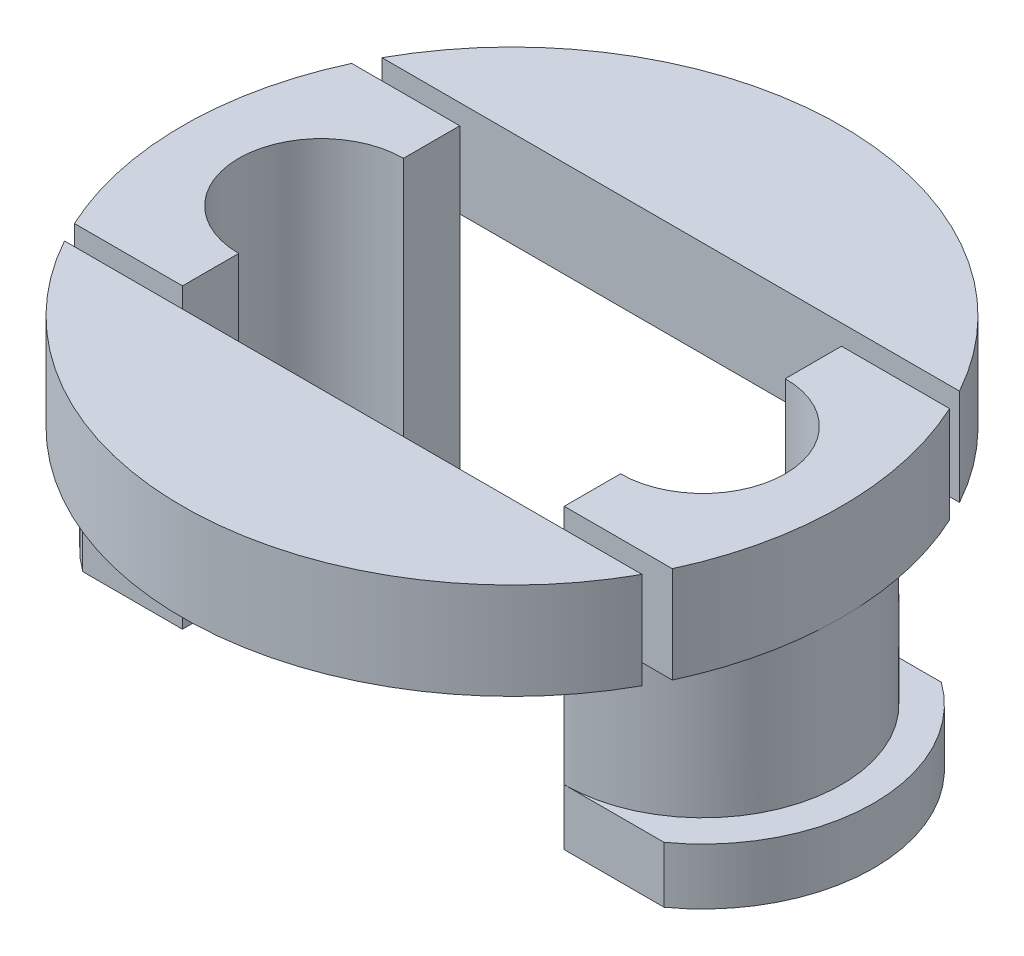
ISO-10303-21;
HEADER;
FILE_DESCRIPTION(('STEP AP214'),'2;1');
FILE_NAME('part.step','',(''),(''),'','','');
FILE_SCHEMA(('AUTOMOTIVE_DESIGN { 1 0 10303 214 1 1 1 1 }'));
ENDSEC;
DATA;
#1=APPLICATION_CONTEXT('core data for automotive mechanical design processes');
#2=APPLICATION_PROTOCOL_DEFINITION('international standard','automotive_design',2000,#1);
#3=PRODUCT_CONTEXT('',#1,'mechanical');
#4=PRODUCT('Part','Part','',(#3));
#5=PRODUCT_RELATED_PRODUCT_CATEGORY('part','',(#4));
#6=PRODUCT_DEFINITION_FORMATION('','',#4);
#7=PRODUCT_DEFINITION_CONTEXT('part definition',#1,'design');
#8=PRODUCT_DEFINITION('design','',#6,#7);
#9=PRODUCT_DEFINITION_SHAPE('','',#8);
#10=(LENGTH_UNIT() NAMED_UNIT(*) SI_UNIT(.MILLI.,.METRE.));
#11=(NAMED_UNIT(*) PLANE_ANGLE_UNIT() SI_UNIT($,.RADIAN.));
#12=(NAMED_UNIT(*) SI_UNIT($,.STERADIAN.) SOLID_ANGLE_UNIT());
#13=UNCERTAINTY_MEASURE_WITH_UNIT(LENGTH_MEASURE(1.E-05),#10,'distance_accuracy_value','');
#14=(GEOMETRIC_REPRESENTATION_CONTEXT(3) GLOBAL_UNCERTAINTY_ASSIGNED_CONTEXT((#13)) GLOBAL_UNIT_ASSIGNED_CONTEXT((#10,
#11,#12)) REPRESENTATION_CONTEXT('',''));
#15=CARTESIAN_POINT('',(0.,0.,0.));
#16=DIRECTION('',(0.,0.,1.));
#17=DIRECTION('',(1.,0.,0.));
#18=AXIS2_PLACEMENT_3D('',#15,#16,#17);
#19=CARTESIAN_POINT('',(-5.6,4.,3.45));
#20=DIRECTION('',(0.,0.,-1.));
#21=DIRECTION('',(-1.,0.,0.));
#22=AXIS2_PLACEMENT_3D('',#19,#20,#21);
#23=PLANE('',#22);
#24=DIRECTION('',(-1.,0.,0.));
#25=VECTOR('',#24,1.);
#26=CARTESIAN_POINT('',(3.9,0.4,3.45));
#27=LINE('',#26,#25);
#28=CARTESIAN_POINT('',(6.38193472919817,0.4,3.45));
#29=VERTEX_POINT('',#28);
#30=CARTESIAN_POINT('',(3.9,0.400000000000001,3.45));
#31=VERTEX_POINT('',#30);
#32=EDGE_CURVE('E221',#29,#31,#27,.T.);
#33=ORIENTED_EDGE('',*,*,#32,.T.);
#34=DIRECTION('',(0.,-1.,0.));
#35=VECTOR('',#34,1.);
#36=CARTESIAN_POINT('',(3.9,18.6476202422854,3.45));
#37=LINE('',#36,#35);
#38=CARTESIAN_POINT('',(3.9,-1.,3.45));
#39=VERTEX_POINT('',#38);
#40=EDGE_CURVE('E163',#31,#39,#37,.T.);
#41=ORIENTED_EDGE('',*,*,#40,.T.);
#42=DIRECTION('',(-1.,0.,0.));
#43=VECTOR('',#42,1.);
#44=CARTESIAN_POINT('',(3.9,-1.,3.45));
#45=LINE('',#44,#43);
#46=CARTESIAN_POINT('',(6.38193472919817,-1.,3.45));
#47=VERTEX_POINT('',#46);
#48=EDGE_CURVE('E176',#47,#39,#45,.T.);
#49=ORIENTED_EDGE('',*,*,#48,.F.);
#50=DIRECTION('',(0.,-1.,0.));
#51=VECTOR('',#50,1.);
#52=CARTESIAN_POINT('',(6.38193472919817,0.4,3.45));
#53=LINE('',#52,#51);
#54=EDGE_CURVE('E162',#29,#47,#53,.T.);
#55=ORIENTED_EDGE('',*,*,#54,.F.);
#56=EDGE_LOOP('',(#33,#41,#49,#55));
#57=FACE_BOUND('',#56,.T.);
#58=ADVANCED_FACE('F43',(#57),#23,.F.);
#59=CARTESIAN_POINT('',(-5.6,4.,-3.45));
#60=DIRECTION('',(0.,0.,1.));
#61=DIRECTION('',(1.,0.,0.));
#62=AXIS2_PLACEMENT_3D('',#59,#60,#61);
#63=PLANE('',#62);
#64=DIRECTION('',(1.,0.,0.));
#65=VECTOR('',#64,1.);
#66=CARTESIAN_POINT('',(-5.6,-1.,-3.45));
#67=LINE('',#66,#65);
#68=CARTESIAN_POINT('',(3.9,-1.,-3.44999999999999));
#69=VERTEX_POINT('',#68);
#70=CARTESIAN_POINT('',(6.38193472919817,-1.,-3.45));
#71=VERTEX_POINT('',#70);
#72=EDGE_CURVE('E172',#69,#71,#67,.T.);
#73=ORIENTED_EDGE('',*,*,#72,.F.);
#74=DIRECTION('',(0.,-1.,0.));
#75=VECTOR('',#74,1.);
#76=CARTESIAN_POINT('',(3.9,18.6476202422854,-3.44999999999999));
#77=LINE('',#76,#75);
#78=CARTESIAN_POINT('',(3.9,0.400000000000001,-3.44999999999999));
#79=VERTEX_POINT('',#78);
#80=EDGE_CURVE('E52',#79,#69,#77,.T.);
#81=ORIENTED_EDGE('',*,*,#80,.F.);
#82=DIRECTION('',(1.,0.,0.));
#83=VECTOR('',#82,1.);
#84=CARTESIAN_POINT('',(3.9,0.4,-3.45));
#85=LINE('',#84,#83);
#86=CARTESIAN_POINT('',(6.38193472919817,0.4,-3.45));
#87=VERTEX_POINT('',#86);
#88=EDGE_CURVE('E186',#79,#87,#85,.T.);
#89=ORIENTED_EDGE('',*,*,#88,.T.);
#90=DIRECTION('',(0.,-1.,0.));
#91=VECTOR('',#90,1.);
#92=CARTESIAN_POINT('',(6.38193472919817,0.4,-3.45));
#93=LINE('',#92,#91);
#94=EDGE_CURVE('E166',#87,#71,#93,.T.);
#95=ORIENTED_EDGE('',*,*,#94,.T.);
#96=EDGE_LOOP('',(#73,#81,#89,#95));
#97=FACE_BOUND('',#96,.T.);
#98=ADVANCED_FACE('F212',(#97),#63,.F.);
#99=CARTESIAN_POINT('',(-0.849999999999999,6.4,0.));
#100=DIRECTION('',(0.,1.,0.));
#101=DIRECTION('',(0.,0.,1.));
#102=AXIS2_PLACEMENT_3D('',#99,#100,#101);
#103=PLANE('',#102);
#104=DIRECTION('',(-1.,0.,0.));
#105=VECTOR('',#104,1.);
#106=CARTESIAN_POINT('',(3.9,6.4,-3.44999999999999));
#107=LINE('',#106,#105);
#108=CARTESIAN_POINT('',(6.58891793206512,6.4,-3.45));
#109=VERTEX_POINT('',#108);
#110=CARTESIAN_POINT('',(3.9,6.4,-3.44999999999999));
#111=VERTEX_POINT('',#110);
#112=EDGE_CURVE('E132',#109,#111,#107,.T.);
#113=ORIENTED_EDGE('',*,*,#112,.T.);
#114=DIRECTION('',(0.,0.,1.));
#115=VECTOR('',#114,1.);
#116=CARTESIAN_POINT('',(3.9,6.4,3.45));
#117=LINE('',#116,#115);
#118=CARTESIAN_POINT('',(3.9,6.4,-2.05));
#119=VERTEX_POINT('',#118);
#120=EDGE_CURVE('E165',#111,#119,#117,.T.);
#121=ORIENTED_EDGE('',*,*,#120,.T.);
#122=CARTESIAN_POINT('',(3.9,6.4,0.));
#123=DIRECTION('',(0.,1.,0.));
#124=DIRECTION('',(0.,0.,1.));
#125=AXIS2_PLACEMENT_3D('',#122,#123,#124);
#126=CIRCLE('',#125,2.05);
#127=CARTESIAN_POINT('',(3.9,6.4,2.05));
#128=VERTEX_POINT('',#127);
#129=EDGE_CURVE('E196',#128,#119,#126,.T.);
#130=ORIENTED_EDGE('',*,*,#129,.F.);
#131=CARTESIAN_POINT('',(3.9,6.4,3.45));
#132=VERTEX_POINT('',#131);
#133=EDGE_CURVE('E169',#128,#132,#117,.T.);
#134=ORIENTED_EDGE('',*,*,#133,.T.);
#135=DIRECTION('',(1.,0.,0.));
#136=VECTOR('',#135,1.);
#137=CARTESIAN_POINT('',(3.9,6.4,3.45));
#138=LINE('',#137,#136);
#139=CARTESIAN_POINT('',(6.58891793206512,6.4,3.45));
#140=VERTEX_POINT('',#139);
#141=EDGE_CURVE('E98',#132,#140,#138,.T.);
#142=ORIENTED_EDGE('',*,*,#141,.T.);
#143=CARTESIAN_POINT('',(-0.849999999999999,6.4,0.));
#144=DIRECTION('',(0.,1.,0.));
#145=DIRECTION('',(0.,0.,1.));
#146=AXIS2_PLACEMENT_3D('',#143,#144,#145);
#147=CIRCLE('',#146,8.2);
#148=EDGE_CURVE('E170',#140,#109,#147,.T.);
#149=ORIENTED_EDGE('',*,*,#148,.T.);
#150=EDGE_LOOP('',(#113,#121,#130,#134,#142,#149));
#151=FACE_BOUND('',#150,.T.);
#152=ADVANCED_FACE('F239',(#151),#103,.T.);
#153=CARTESIAN_POINT('',(-0.849999999999999,4.,0.));
#154=DIRECTION('',(0.,1.,0.));
#155=DIRECTION('',(0.,0.,1.));
#156=AXIS2_PLACEMENT_3D('',#153,#154,#155);
#157=PLANE('',#156);
#158=CARTESIAN_POINT('',(-0.849999999999999,4.,0.));
#159=DIRECTION('',(0.,1.,0.));
#160=DIRECTION('',(0.,0.,1.));
#161=AXIS2_PLACEMENT_3D('',#158,#159,#160);
#162=CIRCLE('',#161,8.2);
#163=CARTESIAN_POINT('',(6.58891793206512,4.,3.45));
#164=VERTEX_POINT('',#163);
#165=CARTESIAN_POINT('',(7.35,4.,0.));
#166=VERTEX_POINT('',#165);
#167=EDGE_CURVE('E148',#164,#166,#162,.T.);
#168=ORIENTED_EDGE('',*,*,#167,.F.);
#169=DIRECTION('',(-1.,0.,0.));
#170=VECTOR('',#169,1.);
#171=CARTESIAN_POINT('',(-0.849999999999999,4.,3.45));
#172=LINE('',#171,#170);
#173=CARTESIAN_POINT('',(3.9,4.,3.45));
#174=VERTEX_POINT('',#173);
#175=EDGE_CURVE('E103',#164,#174,#172,.T.);
#176=ORIENTED_EDGE('',*,*,#175,.T.);
#177=CARTESIAN_POINT('',(3.9,4.,0.));
#178=DIRECTION('',(0.,1.,0.));
#179=DIRECTION('',(0.,0.,1.));
#180=AXIS2_PLACEMENT_3D('',#177,#178,#179);
#181=CIRCLE('',#180,3.45);
#182=EDGE_CURVE('E175',#174,#166,#181,.T.);
#183=ORIENTED_EDGE('',*,*,#182,.T.);
#184=EDGE_LOOP('',(#168,#176,#183));
#185=FACE_BOUND('',#184,.T.);
#186=ADVANCED_FACE('F237',(#185),#157,.F.);
#187=CARTESIAN_POINT('',(-5.6,-1.,0.));
#188=DIRECTION('',(0.,-1.,0.));
#189=DIRECTION('',(0.,0.,-1.));
#190=AXIS2_PLACEMENT_3D('',#187,#188,#189);
#191=PLANE('',#190);
#192=DIRECTION('',(0.,0.,1.));
#193=VECTOR('',#192,1.);
#194=CARTESIAN_POINT('',(3.9,-1.,3.45));
#195=LINE('',#194,#193);
#196=CARTESIAN_POINT('',(3.9,-1.,-2.05));
#197=VERTEX_POINT('',#196);
#198=EDGE_CURVE('E12',#69,#197,#195,.T.);
#199=ORIENTED_EDGE('',*,*,#198,.F.);
#200=ORIENTED_EDGE('',*,*,#72,.T.);
#201=CARTESIAN_POINT('',(3.9,-1.,0.));
#202=DIRECTION('',(0.,-1.,0.));
#203=DIRECTION('',(0.,0.,1.));
#204=AXIS2_PLACEMENT_3D('',#201,#202,#203);
#205=CIRCLE('',#204,4.25);
#206=EDGE_CURVE('E174',#71,#47,#205,.T.);
#207=ORIENTED_EDGE('',*,*,#206,.T.);
#208=ORIENTED_EDGE('',*,*,#48,.T.);
#209=CARTESIAN_POINT('',(3.9,-1.,2.05));
#210=VERTEX_POINT('',#209);
#211=EDGE_CURVE('E54',#210,#39,#195,.T.);
#212=ORIENTED_EDGE('',*,*,#211,.F.);
#213=CARTESIAN_POINT('',(3.9,-1.,0.));
#214=DIRECTION('',(0.,-1.,0.));
#215=DIRECTION('',(0.,0.,-1.));
#216=AXIS2_PLACEMENT_3D('',#213,#214,#215);
#217=CIRCLE('',#216,2.05);
#218=EDGE_CURVE('E193',#197,#210,#217,.T.);
#219=ORIENTED_EDGE('',*,*,#218,.F.);
#220=EDGE_LOOP('',(#199,#200,#207,#208,#212,#219));
#221=FACE_BOUND('',#220,.T.);
#222=ADVANCED_FACE('F211',(#221),#191,.T.);
#223=CARTESIAN_POINT('',(3.9,4.,-3.44999999999999));
#224=VERTEX_POINT('',#223);
#225=EDGE_CURVE('E144',#166,#224,#181,.T.);
#226=ORIENTED_EDGE('',*,*,#225,.T.);
#227=DIRECTION('',(1.,0.,0.));
#228=VECTOR('',#227,1.);
#229=CARTESIAN_POINT('',(-0.85,4.,-3.44999999999999));
#230=LINE('',#229,#228);
#231=CARTESIAN_POINT('',(6.58891793206512,4.,-3.45));
#232=VERTEX_POINT('',#231);
#233=EDGE_CURVE('E129',#224,#232,#230,.T.);
#234=ORIENTED_EDGE('',*,*,#233,.T.);
#235=EDGE_CURVE('E46',#166,#232,#162,.T.);
#236=ORIENTED_EDGE('',*,*,#235,.F.);
#237=EDGE_LOOP('',(#226,#234,#236));
#238=FACE_BOUND('',#237,.T.);
#239=ADVANCED_FACE('F142',(#238),#157,.F.);
#240=CARTESIAN_POINT('',(-0.849999999999999,6.4,0.));
#241=DIRECTION('',(0.,-1.,0.));
#242=DIRECTION('',(0.,0.,-1.));
#243=AXIS2_PLACEMENT_3D('',#240,#241,#242);
#244=CYLINDRICAL_SURFACE('',#243,8.2);
#245=ORIENTED_EDGE('',*,*,#235,.T.);
#246=DIRECTION('',(0.,-1.,0.));
#247=VECTOR('',#246,1.);
#248=CARTESIAN_POINT('',(6.58891793206512,6.4,-3.45));
#249=LINE('',#248,#247);
#250=EDGE_CURVE('E125',#232,#109,#249,.F.);
#251=ORIENTED_EDGE('',*,*,#250,.T.);
#252=ORIENTED_EDGE('',*,*,#148,.F.);
#253=DIRECTION('',(0.,-1.,0.));
#254=VECTOR('',#253,1.);
#255=CARTESIAN_POINT('',(6.58891793206512,6.4,3.45));
#256=LINE('',#255,#254);
#257=EDGE_CURVE('E137',#140,#164,#256,.T.);
#258=ORIENTED_EDGE('',*,*,#257,.T.);
#259=ORIENTED_EDGE('',*,*,#167,.T.);
#260=EDGE_LOOP('',(#245,#251,#252,#258,#259));
#261=FACE_BOUND('',#260,.T.);
#262=ADVANCED_FACE('F146',(#261),#244,.T.);
#263=CARTESIAN_POINT('',(3.9,4.,0.));
#264=DIRECTION('',(0.,-1.,0.));
#265=DIRECTION('',(0.,0.,-1.));
#266=AXIS2_PLACEMENT_3D('',#263,#264,#265);
#267=CYLINDRICAL_SURFACE('',#266,3.45);
#268=DIRECTION('',(0.,-1.,0.));
#269=VECTOR('',#268,1.);
#270=CARTESIAN_POINT('',(3.9,4.,3.45));
#271=LINE('',#270,#269);
#272=EDGE_CURVE('E149',#174,#31,#271,.T.);
#273=ORIENTED_EDGE('',*,*,#272,.T.);
#274=CARTESIAN_POINT('',(3.9,0.4,0.));
#275=DIRECTION('',(0.,1.,0.));
#276=DIRECTION('',(0.,0.,1.));
#277=AXIS2_PLACEMENT_3D('',#274,#275,#276);
#278=CIRCLE('',#277,3.45);
#279=EDGE_CURVE('E151',#31,#79,#278,.T.);
#280=ORIENTED_EDGE('',*,*,#279,.T.);
#281=DIRECTION('',(0.,-1.,0.));
#282=VECTOR('',#281,1.);
#283=CARTESIAN_POINT('',(3.9,4.,-3.45));
#284=LINE('',#283,#282);
#285=EDGE_CURVE('E158',#224,#79,#284,.T.);
#286=ORIENTED_EDGE('',*,*,#285,.F.);
#287=ORIENTED_EDGE('',*,*,#225,.F.);
#288=ORIENTED_EDGE('',*,*,#182,.F.);
#289=EDGE_LOOP('',(#273,#280,#286,#287,#288));
#290=FACE_BOUND('',#289,.T.);
#291=ADVANCED_FACE('F229',(#290),#267,.T.);
#292=CARTESIAN_POINT('',(3.9,4.,0.));
#293=DIRECTION('',(0.,-1.,0.));
#294=DIRECTION('',(0.,0.,-1.));
#295=AXIS2_PLACEMENT_3D('',#292,#293,#294);
#296=CYLINDRICAL_SURFACE('',#295,2.05);
#297=DIRECTION('',(0.,-1.,0.));
#298=VECTOR('',#297,1.);
#299=CARTESIAN_POINT('',(3.9,4.,-2.05));
#300=LINE('',#299,#298);
#301=EDGE_CURVE('E197',#119,#197,#300,.T.);
#302=ORIENTED_EDGE('',*,*,#301,.T.);
#303=ORIENTED_EDGE('',*,*,#218,.T.);
#304=DIRECTION('',(0.,-1.,0.));
#305=VECTOR('',#304,1.);
#306=CARTESIAN_POINT('',(3.9,4.,2.05));
#307=LINE('',#306,#305);
#308=EDGE_CURVE('E161',#128,#210,#307,.T.);
#309=ORIENTED_EDGE('',*,*,#308,.F.);
#310=ORIENTED_EDGE('',*,*,#129,.T.);
#311=EDGE_LOOP('',(#302,#303,#309,#310));
#312=FACE_BOUND('',#311,.T.);
#313=ADVANCED_FACE('F262',(#312),#296,.F.);
#314=CARTESIAN_POINT('',(3.9,0.4,0.));
#315=DIRECTION('',(0.,-1.,0.));
#316=DIRECTION('',(0.,0.,-1.));
#317=AXIS2_PLACEMENT_3D('',#314,#315,#316);
#318=CYLINDRICAL_SURFACE('',#317,4.25);
#319=ORIENTED_EDGE('',*,*,#206,.F.);
#320=ORIENTED_EDGE('',*,*,#94,.F.);
#321=CARTESIAN_POINT('',(3.9,0.4,0.));
#322=DIRECTION('',(0.,-1.,0.));
#323=DIRECTION('',(0.,0.,1.));
#324=AXIS2_PLACEMENT_3D('',#321,#322,#323);
#325=CIRCLE('',#324,4.25);
#326=EDGE_CURVE('E192',#87,#29,#325,.T.);
#327=ORIENTED_EDGE('',*,*,#326,.T.);
#328=ORIENTED_EDGE('',*,*,#54,.T.);
#329=EDGE_LOOP('',(#319,#320,#327,#328));
#330=FACE_BOUND('',#329,.T.);
#331=ADVANCED_FACE('F216',(#330),#318,.T.);
#332=CARTESIAN_POINT('',(3.9,0.4,0.));
#333=DIRECTION('',(0.,1.,0.));
#334=DIRECTION('',(0.,0.,1.));
#335=AXIS2_PLACEMENT_3D('',#332,#333,#334);
#336=PLANE('',#335);
#337=ORIENTED_EDGE('',*,*,#326,.F.);
#338=ORIENTED_EDGE('',*,*,#88,.F.);
#339=ORIENTED_EDGE('',*,*,#279,.F.);
#340=ORIENTED_EDGE('',*,*,#32,.F.);
#341=EDGE_LOOP('',(#337,#338,#339,#340));
#342=FACE_BOUND('',#341,.T.);
#343=ADVANCED_FACE('F224',(#342),#336,.T.);
#344=CARTESIAN_POINT('',(3.9,18.6476202422854,3.45));
#345=DIRECTION('',(0.,0.,-1.));
#346=DIRECTION('',(-1.,0.,0.));
#347=AXIS2_PLACEMENT_3D('',#344,#345,#346);
#348=PLANE('',#347);
#349=ORIENTED_EDGE('',*,*,#257,.F.);
#350=ORIENTED_EDGE('',*,*,#141,.F.);
#351=EDGE_CURVE('E159',#132,#174,#37,.T.);
#352=ORIENTED_EDGE('',*,*,#351,.T.);
#353=ORIENTED_EDGE('',*,*,#175,.F.);
#354=EDGE_LOOP('',(#349,#350,#352,#353));
#355=FACE_BOUND('',#354,.T.);
#356=ADVANCED_FACE('F235',(#355),#348,.F.);
#357=CARTESIAN_POINT('',(3.9,18.6476202422854,3.45));
#358=DIRECTION('',(1.,0.,0.));
#359=DIRECTION('',(0.,0.,-1.));
#360=AXIS2_PLACEMENT_3D('',#357,#358,#359);
#361=PLANE('',#360);
#362=ORIENTED_EDGE('',*,*,#308,.T.);
#363=ORIENTED_EDGE('',*,*,#211,.T.);
#364=ORIENTED_EDGE('',*,*,#40,.F.);
#365=ORIENTED_EDGE('',*,*,#272,.F.);
#366=ORIENTED_EDGE('',*,*,#351,.F.);
#367=ORIENTED_EDGE('',*,*,#133,.F.);
#368=EDGE_LOOP('',(#362,#363,#364,#365,#366,#367));
#369=FACE_BOUND('',#368,.T.);
#370=ADVANCED_FACE('F232',(#369),#361,.F.);
#371=CARTESIAN_POINT('',(3.9,18.6476202422854,-3.44999999999999));
#372=DIRECTION('',(0.,0.,1.));
#373=DIRECTION('',(1.,0.,0.));
#374=AXIS2_PLACEMENT_3D('',#371,#372,#373);
#375=PLANE('',#374);
#376=EDGE_CURVE('E156',#111,#224,#77,.T.);
#377=ORIENTED_EDGE('',*,*,#376,.F.);
#378=ORIENTED_EDGE('',*,*,#112,.F.);
#379=ORIENTED_EDGE('',*,*,#250,.F.);
#380=ORIENTED_EDGE('',*,*,#233,.F.);
#381=EDGE_LOOP('',(#377,#378,#379,#380));
#382=FACE_BOUND('',#381,.T.);
#383=ADVANCED_FACE('F128',(#382),#375,.F.);
#384=ORIENTED_EDGE('',*,*,#301,.F.);
#385=ORIENTED_EDGE('',*,*,#120,.F.);
#386=ORIENTED_EDGE('',*,*,#376,.T.);
#387=ORIENTED_EDGE('',*,*,#285,.T.);
#388=ORIENTED_EDGE('',*,*,#80,.T.);
#389=ORIENTED_EDGE('',*,*,#198,.T.);
#390=EDGE_LOOP('',(#384,#385,#386,#387,#388,#389));
#391=FACE_BOUND('',#390,.T.);
#392=ADVANCED_FACE('F205',(#391),#361,.F.);
#393=CLOSED_SHELL('',(#58,#98,#152,#186,#222,#239,#262,#291,#313,#331,#343,#356,#370,#383,#392));
#394=MANIFOLD_SOLID_BREP('B2',#393);
#395=CARTESIAN_POINT('',(-5.1,18.6476202422854,3.95));
#396=DIRECTION('',(0.,0.,1.));
#397=DIRECTION('',(1.,0.,0.));
#398=AXIS2_PLACEMENT_3D('',#395,#396,#397);
#399=PLANE('',#398);
#400=DIRECTION('',(0.,-1.,0.));
#401=VECTOR('',#400,1.);
#402=CARTESIAN_POINT('',(-8.03592374020209,6.4,3.95));
#403=LINE('',#402,#401);
#404=CARTESIAN_POINT('',(-8.03592374020209,6.4,3.95));
#405=VERTEX_POINT('',#404);
#406=CARTESIAN_POINT('',(-8.03592374020209,4.,3.95));
#407=VERTEX_POINT('',#406);
#408=EDGE_CURVE('E435',#405,#407,#403,.T.);
#409=ORIENTED_EDGE('',*,*,#408,.F.);
#410=DIRECTION('',(-1.,0.,0.));
#411=VECTOR('',#410,1.);
#412=CARTESIAN_POINT('',(3.4,6.4,3.95));
#413=LINE('',#412,#411);
#414=CARTESIAN_POINT('',(6.33592374020209,6.4,3.95));
#415=VERTEX_POINT('',#414);
#416=EDGE_CURVE('E415',#415,#405,#413,.T.);
#417=ORIENTED_EDGE('',*,*,#416,.F.);
#418=DIRECTION('',(0.,-1.,0.));
#419=VECTOR('',#418,1.);
#420=CARTESIAN_POINT('',(6.33592374020209,6.4,3.95));
#421=LINE('',#420,#419);
#422=CARTESIAN_POINT('',(6.33592374020209,4.,3.95));
#423=VERTEX_POINT('',#422);
#424=EDGE_CURVE('E422',#423,#415,#421,.F.);
#425=ORIENTED_EDGE('',*,*,#424,.F.);
#426=DIRECTION('',(1.,0.,0.));
#427=VECTOR('',#426,1.);
#428=CARTESIAN_POINT('',(-0.85,4.,3.95));
#429=LINE('',#428,#427);
#430=EDGE_CURVE('E432',#407,#423,#429,.T.);
#431=ORIENTED_EDGE('',*,*,#430,.F.);
#432=EDGE_LOOP('',(#409,#417,#425,#431));
#433=FACE_BOUND('',#432,.T.);
#434=ADVANCED_FACE('F406',(#433),#399,.F.);
#435=CARTESIAN_POINT('',(-0.849999999999999,6.4,0.));
#436=DIRECTION('',(0.,-1.,0.));
#437=DIRECTION('',(0.,0.,-1.));
#438=AXIS2_PLACEMENT_3D('',#435,#436,#437);
#439=CYLINDRICAL_SURFACE('',#438,8.2);
#440=CARTESIAN_POINT('',(-0.849999999999999,4.,0.));
#441=DIRECTION('',(0.,1.,0.));
#442=DIRECTION('',(0.,0.,1.));
#443=AXIS2_PLACEMENT_3D('',#440,#441,#442);
#444=CIRCLE('',#443,8.2);
#445=EDGE_CURVE('E410',#407,#423,#444,.T.);
#446=ORIENTED_EDGE('',*,*,#445,.T.);
#447=ORIENTED_EDGE('',*,*,#424,.T.);
#448=CARTESIAN_POINT('',(-0.849999999999999,6.4,0.));
#449=DIRECTION('',(0.,1.,0.));
#450=DIRECTION('',(0.,0.,1.));
#451=AXIS2_PLACEMENT_3D('',#448,#449,#450);
#452=CIRCLE('',#451,8.2);
#453=EDGE_CURVE('E41',#405,#415,#452,.T.);
#454=ORIENTED_EDGE('',*,*,#453,.F.);
#455=ORIENTED_EDGE('',*,*,#408,.T.);
#456=EDGE_LOOP('',(#446,#447,#454,#455));
#457=FACE_BOUND('',#456,.T.);
#458=ADVANCED_FACE('F440',(#457),#439,.T.);
#459=CARTESIAN_POINT('',(-0.849999999999999,4.,0.));
#460=DIRECTION('',(0.,1.,0.));
#461=DIRECTION('',(0.,0.,1.));
#462=AXIS2_PLACEMENT_3D('',#459,#460,#461);
#463=PLANE('',#462);
#464=ORIENTED_EDGE('',*,*,#445,.F.);
#465=ORIENTED_EDGE('',*,*,#430,.T.);
#466=EDGE_LOOP('',(#464,#465));
#467=FACE_BOUND('',#466,.T.);
#468=ADVANCED_FACE('F444',(#467),#463,.F.);
#469=CARTESIAN_POINT('',(-0.849999999999999,6.4,0.));
#470=DIRECTION('',(0.,1.,0.));
#471=DIRECTION('',(0.,0.,1.));
#472=AXIS2_PLACEMENT_3D('',#469,#470,#471);
#473=PLANE('',#472);
#474=ORIENTED_EDGE('',*,*,#416,.T.);
#475=ORIENTED_EDGE('',*,*,#453,.T.);
#476=EDGE_LOOP('',(#474,#475));
#477=FACE_BOUND('',#476,.T.);
#478=ADVANCED_FACE('F408',(#477),#473,.T.);
#479=CLOSED_SHELL('',(#434,#458,#468,#478));
#480=MANIFOLD_SOLID_BREP('B6',#479);
#481=CARTESIAN_POINT('',(-5.1,18.6476202422854,-3.95));
#482=DIRECTION('',(0.,0.,-1.));
#483=DIRECTION('',(-1.,0.,0.));
#484=AXIS2_PLACEMENT_3D('',#481,#482,#483);
#485=PLANE('',#484);
#486=DIRECTION('',(-1.,0.,0.));
#487=VECTOR('',#486,1.);
#488=CARTESIAN_POINT('',(-0.849999999999999,4.,-3.95));
#489=LINE('',#488,#487);
#490=CARTESIAN_POINT('',(6.33592374020209,4.,-3.94999999999999));
#491=VERTEX_POINT('',#490);
#492=CARTESIAN_POINT('',(-8.03592374020209,4.,-3.95));
#493=VERTEX_POINT('',#492);
#494=EDGE_CURVE('E508',#491,#493,#489,.T.);
#495=ORIENTED_EDGE('',*,*,#494,.F.);
#496=DIRECTION('',(0.,-1.,0.));
#497=VECTOR('',#496,1.);
#498=CARTESIAN_POINT('',(6.33592374020209,6.4,-3.94999999999999));
#499=LINE('',#498,#497);
#500=CARTESIAN_POINT('',(6.33592374020209,6.4,-3.94999999999999));
#501=VERTEX_POINT('',#500);
#502=EDGE_CURVE('E404',#501,#491,#499,.T.);
#503=ORIENTED_EDGE('',*,*,#502,.F.);
#504=DIRECTION('',(1.,0.,0.));
#505=VECTOR('',#504,1.);
#506=CARTESIAN_POINT('',(-5.1,6.4,-3.95));
#507=LINE('',#506,#505);
#508=CARTESIAN_POINT('',(-8.03592374020209,6.4,-3.95));
#509=VERTEX_POINT('',#508);
#510=EDGE_CURVE('E522',#509,#501,#507,.T.);
#511=ORIENTED_EDGE('',*,*,#510,.F.);
#512=DIRECTION('',(0.,-1.,0.));
#513=VECTOR('',#512,1.);
#514=CARTESIAN_POINT('',(-8.03592374020209,6.4,-3.95));
#515=LINE('',#514,#513);
#516=EDGE_CURVE('E501',#493,#509,#515,.F.);
#517=ORIENTED_EDGE('',*,*,#516,.F.);
#518=EDGE_LOOP('',(#495,#503,#511,#517));
#519=FACE_BOUND('',#518,.T.);
#520=ADVANCED_FACE('F493',(#519),#485,.F.);
#521=CARTESIAN_POINT('',(-0.849999999999999,6.4,0.));
#522=DIRECTION('',(0.,-1.,0.));
#523=DIRECTION('',(0.,0.,-1.));
#524=AXIS2_PLACEMENT_3D('',#521,#522,#523);
#525=CYLINDRICAL_SURFACE('',#524,8.2);
#526=CARTESIAN_POINT('',(-0.849999999999999,6.4,0.));
#527=DIRECTION('',(0.,1.,0.));
#528=DIRECTION('',(0.,0.,1.));
#529=AXIS2_PLACEMENT_3D('',#526,#527,#528);
#530=CIRCLE('',#529,8.2);
#531=EDGE_CURVE('E524',#501,#509,#530,.T.);
#532=ORIENTED_EDGE('',*,*,#531,.F.);
#533=ORIENTED_EDGE('',*,*,#502,.T.);
#534=CARTESIAN_POINT('',(-0.849999999999999,4.,0.));
#535=DIRECTION('',(0.,1.,0.));
#536=DIRECTION('',(0.,0.,1.));
#537=AXIS2_PLACEMENT_3D('',#534,#535,#536);
#538=CIRCLE('',#537,8.2);
#539=EDGE_CURVE('E515',#491,#493,#538,.T.);
#540=ORIENTED_EDGE('',*,*,#539,.T.);
#541=ORIENTED_EDGE('',*,*,#516,.T.);
#542=EDGE_LOOP('',(#532,#533,#540,#541));
#543=FACE_BOUND('',#542,.T.);
#544=ADVANCED_FACE('F526',(#543),#525,.T.);
#545=CARTESIAN_POINT('',(-0.849999999999999,4.,0.));
#546=DIRECTION('',(0.,1.,0.));
#547=DIRECTION('',(0.,0.,1.));
#548=AXIS2_PLACEMENT_3D('',#545,#546,#547);
#549=PLANE('',#548);
#550=ORIENTED_EDGE('',*,*,#539,.F.);
#551=ORIENTED_EDGE('',*,*,#494,.T.);
#552=EDGE_LOOP('',(#550,#551));
#553=FACE_BOUND('',#552,.T.);
#554=ADVANCED_FACE('F531',(#553),#549,.F.);
#555=CARTESIAN_POINT('',(-0.849999999999999,6.4,0.));
#556=DIRECTION('',(0.,1.,0.));
#557=DIRECTION('',(0.,0.,1.));
#558=AXIS2_PLACEMENT_3D('',#555,#556,#557);
#559=PLANE('',#558);
#560=ORIENTED_EDGE('',*,*,#510,.T.);
#561=ORIENTED_EDGE('',*,*,#531,.T.);
#562=EDGE_LOOP('',(#560,#561));
#563=FACE_BOUND('',#562,.T.);
#564=ADVANCED_FACE('F495',(#563),#559,.T.);
#565=CLOSED_SHELL('',(#520,#544,#554,#564));
#566=MANIFOLD_SOLID_BREP('B35',#565);
#567=CARTESIAN_POINT('',(-5.6,0.4,0.));
#568=DIRECTION('',(0.,-1.,0.));
#569=DIRECTION('',(0.,0.,-1.));
#570=AXIS2_PLACEMENT_3D('',#567,#568,#569);
#571=PLANE('',#570);
#572=CARTESIAN_POINT('',(-5.6,0.4,0.));
#573=DIRECTION('',(0.,1.,0.));
#574=DIRECTION('',(0.,0.,-1.));
#575=AXIS2_PLACEMENT_3D('',#572,#573,#574);
#576=CIRCLE('',#575,3.45);
#577=CARTESIAN_POINT('',(-5.6,0.400000000000001,-3.45));
#578=VERTEX_POINT('',#577);
#579=CARTESIAN_POINT('',(-5.6,0.400000000000001,3.45));
#580=VERTEX_POINT('',#579);
#581=EDGE_CURVE('E705',#578,#580,#576,.T.);
#582=ORIENTED_EDGE('',*,*,#581,.F.);
#583=DIRECTION('',(1.,0.,0.));
#584=VECTOR('',#583,1.);
#585=CARTESIAN_POINT('',(-5.6,0.4,-3.45));
#586=LINE('',#585,#584);
#587=CARTESIAN_POINT('',(-8.08193472919817,0.4,-3.45));
#588=VERTEX_POINT('',#587);
#589=EDGE_CURVE('E669',#588,#578,#586,.T.);
#590=ORIENTED_EDGE('',*,*,#589,.F.);
#591=CARTESIAN_POINT('',(-5.6,0.4,0.));
#592=DIRECTION('',(0.,-1.,0.));
#593=DIRECTION('',(0.,0.,-1.));
#594=AXIS2_PLACEMENT_3D('',#591,#592,#593);
#595=CIRCLE('',#594,4.25);
#596=CARTESIAN_POINT('',(-8.08193472919817,0.4,3.45));
#597=VERTEX_POINT('',#596);
#598=EDGE_CURVE('E730',#597,#588,#595,.T.);
#599=ORIENTED_EDGE('',*,*,#598,.F.);
#600=DIRECTION('',(-1.,0.,0.));
#601=VECTOR('',#600,1.);
#602=CARTESIAN_POINT('',(-5.6,0.4,3.45));
#603=LINE('',#602,#601);
#604=EDGE_CURVE('E727',#580,#597,#603,.T.);
#605=ORIENTED_EDGE('',*,*,#604,.F.);
#606=EDGE_LOOP('',(#582,#590,#599,#605));
#607=FACE_BOUND('',#606,.T.);
#608=ADVANCED_FACE('F570',(#607),#571,.F.);
#609=CARTESIAN_POINT('',(-5.6,0.4,0.));
#610=DIRECTION('',(0.,-1.,0.));
#611=DIRECTION('',(0.,0.,-1.));
#612=AXIS2_PLACEMENT_3D('',#609,#610,#611);
#613=CYLINDRICAL_SURFACE('',#612,4.25);
#614=CARTESIAN_POINT('',(-5.6,-1.,0.));
#615=DIRECTION('',(0.,-1.,0.));
#616=DIRECTION('',(0.,0.,-1.));
#617=AXIS2_PLACEMENT_3D('',#614,#615,#616);
#618=CIRCLE('',#617,4.25);
#619=CARTESIAN_POINT('',(-8.08193472919817,-1.,3.45));
#620=VERTEX_POINT('',#619);
#621=CARTESIAN_POINT('',(-8.08193472919817,-1.,-3.45));
#622=VERTEX_POINT('',#621);
#623=EDGE_CURVE('E677',#620,#622,#618,.T.);
#624=ORIENTED_EDGE('',*,*,#623,.F.);
#625=DIRECTION('',(0.,-1.,0.));
#626=VECTOR('',#625,1.);
#627=CARTESIAN_POINT('',(-8.08193472919817,0.4,3.45));
#628=LINE('',#627,#626);
#629=EDGE_CURVE('E733',#597,#620,#628,.T.);
#630=ORIENTED_EDGE('',*,*,#629,.F.);
#631=ORIENTED_EDGE('',*,*,#598,.T.);
#632=DIRECTION('',(0.,-1.,0.));
#633=VECTOR('',#632,1.);
#634=CARTESIAN_POINT('',(-8.08193472919817,0.4,-3.45));
#635=LINE('',#634,#633);
#636=EDGE_CURVE('E683',#588,#622,#635,.T.);
#637=ORIENTED_EDGE('',*,*,#636,.T.);
#638=EDGE_LOOP('',(#624,#630,#631,#637));
#639=FACE_BOUND('',#638,.T.);
#640=ADVANCED_FACE('F742',(#639),#613,.T.);
#641=CARTESIAN_POINT('',(-0.849999999999999,6.4,0.));
#642=DIRECTION('',(0.,-1.,0.));
#643=DIRECTION('',(0.,0.,-1.));
#644=AXIS2_PLACEMENT_3D('',#641,#642,#643);
#645=CYLINDRICAL_SURFACE('',#644,8.2);
#646=CARTESIAN_POINT('',(-0.849999999999999,6.4,0.));
#647=DIRECTION('',(0.,1.,0.));
#648=DIRECTION('',(0.,0.,1.));
#649=AXIS2_PLACEMENT_3D('',#646,#647,#648);
#650=CIRCLE('',#649,8.2);
#651=CARTESIAN_POINT('',(-8.28891793206512,6.4,-3.45));
#652=VERTEX_POINT('',#651);
#653=CARTESIAN_POINT('',(-8.28891793206512,6.4,3.45));
#654=VERTEX_POINT('',#653);
#655=EDGE_CURVE('E690',#652,#654,#650,.T.);
#656=ORIENTED_EDGE('',*,*,#655,.F.);
#657=DIRECTION('',(0.,-1.,0.));
#658=VECTOR('',#657,1.);
#659=CARTESIAN_POINT('',(-8.28891793206512,6.4,-3.45));
#660=LINE('',#659,#658);
#661=CARTESIAN_POINT('',(-8.28891793206512,4.,-3.45));
#662=VERTEX_POINT('',#661);
#663=EDGE_CURVE('E719',#652,#662,#660,.T.);
#664=ORIENTED_EDGE('',*,*,#663,.T.);
#665=CARTESIAN_POINT('',(-0.849999999999999,4.,0.));
#666=DIRECTION('',(0.,1.,0.));
#667=DIRECTION('',(0.,0.,1.));
#668=AXIS2_PLACEMENT_3D('',#665,#666,#667);
#669=CIRCLE('',#668,8.2);
#670=CARTESIAN_POINT('',(-9.05,4.,0.));
#671=VERTEX_POINT('',#670);
#672=EDGE_CURVE('E592',#662,#671,#669,.T.);
#673=ORIENTED_EDGE('',*,*,#672,.T.);
#674=CARTESIAN_POINT('',(-8.28891793206512,4.,3.45));
#675=VERTEX_POINT('',#674);
#676=EDGE_CURVE('E689',#671,#675,#669,.T.);
#677=ORIENTED_EDGE('',*,*,#676,.T.);
#678=DIRECTION('',(0.,-1.,0.));
#679=VECTOR('',#678,1.);
#680=CARTESIAN_POINT('',(-8.28891793206512,6.4,3.45));
#681=LINE('',#680,#679);
#682=EDGE_CURVE('E715',#675,#654,#681,.F.);
#683=ORIENTED_EDGE('',*,*,#682,.T.);
#684=EDGE_LOOP('',(#656,#664,#673,#677,#683));
#685=FACE_BOUND('',#684,.T.);
#686=ADVANCED_FACE('F751',(#685),#645,.T.);
#687=CARTESIAN_POINT('',(-0.849999999999999,4.,0.));
#688=DIRECTION('',(0.,1.,0.));
#689=DIRECTION('',(0.,0.,1.));
#690=AXIS2_PLACEMENT_3D('',#687,#688,#689);
#691=PLANE('',#690);
#692=CARTESIAN_POINT('',(-5.6,4.,0.));
#693=DIRECTION('',(0.,1.,0.));
#694=DIRECTION('',(0.,0.,1.));
#695=AXIS2_PLACEMENT_3D('',#692,#693,#694);
#696=CIRCLE('',#695,3.45);
#697=CARTESIAN_POINT('',(-5.6,4.,3.45));
#698=VERTEX_POINT('',#697);
#699=EDGE_CURVE('E698',#671,#698,#696,.T.);
#700=ORIENTED_EDGE('',*,*,#699,.T.);
#701=DIRECTION('',(-1.,0.,0.));
#702=VECTOR('',#701,1.);
#703=CARTESIAN_POINT('',(-0.849999999999999,4.,3.45));
#704=LINE('',#703,#702);
#705=EDGE_CURVE('E722',#698,#675,#704,.T.);
#706=ORIENTED_EDGE('',*,*,#705,.T.);
#707=ORIENTED_EDGE('',*,*,#676,.F.);
#708=EDGE_LOOP('',(#700,#706,#707));
#709=FACE_BOUND('',#708,.T.);
#710=ADVANCED_FACE('F762',(#709),#691,.F.);
#711=CARTESIAN_POINT('',(-0.849999999999999,6.4,0.));
#712=DIRECTION('',(0.,1.,0.));
#713=DIRECTION('',(0.,0.,1.));
#714=AXIS2_PLACEMENT_3D('',#711,#712,#713);
#715=PLANE('',#714);
#716=DIRECTION('',(-1.,0.,0.));
#717=VECTOR('',#716,1.);
#718=CARTESIAN_POINT('',(-5.6,6.4,-3.45));
#719=LINE('',#718,#717);
#720=CARTESIAN_POINT('',(-5.6,6.4,-3.45));
#721=VERTEX_POINT('',#720);
#722=EDGE_CURVE('E714',#721,#652,#719,.T.);
#723=ORIENTED_EDGE('',*,*,#722,.T.);
#724=ORIENTED_EDGE('',*,*,#655,.T.);
#725=DIRECTION('',(1.,0.,0.));
#726=VECTOR('',#725,1.);
#727=CARTESIAN_POINT('',(-5.6,6.4,3.45));
#728=LINE('',#727,#726);
#729=CARTESIAN_POINT('',(-5.6,6.4,3.45));
#730=VERTEX_POINT('',#729);
#731=EDGE_CURVE('E907',#654,#730,#728,.T.);
#732=ORIENTED_EDGE('',*,*,#731,.T.);
#733=DIRECTION('',(0.,0.,-1.));
#734=VECTOR('',#733,1.);
#735=CARTESIAN_POINT('',(-5.6,6.4,3.45));
#736=LINE('',#735,#734);
#737=CARTESIAN_POINT('',(-5.6,6.4,2.05));
#738=VERTEX_POINT('',#737);
#739=EDGE_CURVE('E672',#730,#738,#736,.T.);
#740=ORIENTED_EDGE('',*,*,#739,.T.);
#741=CARTESIAN_POINT('',(-5.6,6.4,0.));
#742=DIRECTION('',(0.,1.,0.));
#743=DIRECTION('',(0.,0.,1.));
#744=AXIS2_PLACEMENT_3D('',#741,#742,#743);
#745=CIRCLE('',#744,2.05);
#746=CARTESIAN_POINT('',(-5.6,6.4,-2.05));
#747=VERTEX_POINT('',#746);
#748=EDGE_CURVE('E681',#747,#738,#745,.T.);
#749=ORIENTED_EDGE('',*,*,#748,.F.);
#750=EDGE_CURVE('E910',#747,#721,#736,.T.);
#751=ORIENTED_EDGE('',*,*,#750,.T.);
#752=EDGE_LOOP('',(#723,#724,#732,#740,#749,#751));
#753=FACE_BOUND('',#752,.T.);
#754=ADVANCED_FACE('F759',(#753),#715,.T.);
#755=ORIENTED_EDGE('',*,*,#672,.F.);
#756=DIRECTION('',(1.,0.,0.));
#757=VECTOR('',#756,1.);
#758=CARTESIAN_POINT('',(-0.849999999999999,4.,-3.45));
#759=LINE('',#758,#757);
#760=CARTESIAN_POINT('',(-5.6,4.,-3.45));
#761=VERTEX_POINT('',#760);
#762=EDGE_CURVE('E712',#662,#761,#759,.T.);
#763=ORIENTED_EDGE('',*,*,#762,.T.);
#764=EDGE_CURVE('E699',#761,#671,#696,.T.);
#765=ORIENTED_EDGE('',*,*,#764,.T.);
#766=EDGE_LOOP('',(#755,#763,#765));
#767=FACE_BOUND('',#766,.T.);
#768=ADVANCED_FACE('F717',(#767),#691,.F.);
#769=CARTESIAN_POINT('',(-5.6,-1.,0.));
#770=DIRECTION('',(0.,-1.,0.));
#771=DIRECTION('',(0.,0.,-1.));
#772=AXIS2_PLACEMENT_3D('',#769,#770,#771);
#773=PLANE('',#772);
#774=DIRECTION('',(0.,0.,-1.));
#775=VECTOR('',#774,1.);
#776=CARTESIAN_POINT('',(-5.6,-1.,3.45));
#777=LINE('',#776,#775);
#778=CARTESIAN_POINT('',(-5.6,-1.,3.45));
#779=VERTEX_POINT('',#778);
#780=CARTESIAN_POINT('',(-5.6,-1.,2.05));
#781=VERTEX_POINT('',#780);
#782=EDGE_CURVE('E661',#779,#781,#777,.T.);
#783=ORIENTED_EDGE('',*,*,#782,.F.);
#784=DIRECTION('',(-1.,0.,0.));
#785=VECTOR('',#784,1.);
#786=CARTESIAN_POINT('',(3.9,-1.,3.45));
#787=LINE('',#786,#785);
#788=EDGE_CURVE('E678',#779,#620,#787,.T.);
#789=ORIENTED_EDGE('',*,*,#788,.T.);
#790=ORIENTED_EDGE('',*,*,#623,.T.);
#791=DIRECTION('',(1.,0.,0.));
#792=VECTOR('',#791,1.);
#793=CARTESIAN_POINT('',(-5.6,-1.,-3.45));
#794=LINE('',#793,#792);
#795=CARTESIAN_POINT('',(-5.6,-1.,-3.45));
#796=VERTEX_POINT('',#795);
#797=EDGE_CURVE('E666',#622,#796,#794,.T.);
#798=ORIENTED_EDGE('',*,*,#797,.T.);
#799=CARTESIAN_POINT('',(-5.6,-1.,-2.05));
#800=VERTEX_POINT('',#799);
#801=EDGE_CURVE('E650',#800,#796,#777,.T.);
#802=ORIENTED_EDGE('',*,*,#801,.F.);
#803=CARTESIAN_POINT('',(-5.6,-1.,0.));
#804=DIRECTION('',(0.,-1.,0.));
#805=DIRECTION('',(0.,0.,-1.));
#806=AXIS2_PLACEMENT_3D('',#803,#804,#805);
#807=CIRCLE('',#806,2.05);
#808=EDGE_CURVE('E679',#781,#800,#807,.T.);
#809=ORIENTED_EDGE('',*,*,#808,.F.);
#810=EDGE_LOOP('',(#783,#789,#790,#798,#802,#809));
#811=FACE_BOUND('',#810,.T.);
#812=ADVANCED_FACE('F675',(#811),#773,.T.);
#813=CARTESIAN_POINT('',(-5.6,4.,0.));
#814=DIRECTION('',(0.,-1.,0.));
#815=DIRECTION('',(0.,0.,-1.));
#816=AXIS2_PLACEMENT_3D('',#813,#814,#815);
#817=CYLINDRICAL_SURFACE('',#816,2.05);
#818=DIRECTION('',(0.,-1.,0.));
#819=VECTOR('',#818,1.);
#820=CARTESIAN_POINT('',(-5.6,4.,2.05));
#821=LINE('',#820,#819);
#822=EDGE_CURVE('E695',#738,#781,#821,.T.);
#823=ORIENTED_EDGE('',*,*,#822,.T.);
#824=ORIENTED_EDGE('',*,*,#808,.T.);
#825=DIRECTION('',(0.,-1.,0.));
#826=VECTOR('',#825,1.);
#827=CARTESIAN_POINT('',(-5.6,4.,-2.05));
#828=LINE('',#827,#826);
#829=EDGE_CURVE('E656',#747,#800,#828,.T.);
#830=ORIENTED_EDGE('',*,*,#829,.F.);
#831=ORIENTED_EDGE('',*,*,#748,.T.);
#832=EDGE_LOOP('',(#823,#824,#830,#831));
#833=FACE_BOUND('',#832,.T.);
#834=ADVANCED_FACE('F758',(#833),#817,.F.);
#835=CARTESIAN_POINT('',(-5.6,4.,-3.45));
#836=DIRECTION('',(0.,0.,1.));
#837=DIRECTION('',(1.,0.,0.));
#838=AXIS2_PLACEMENT_3D('',#835,#836,#837);
#839=PLANE('',#838);
#840=ORIENTED_EDGE('',*,*,#589,.T.);
#841=DIRECTION('',(0.,-1.,0.));
#842=VECTOR('',#841,1.);
#843=CARTESIAN_POINT('',(-5.6,18.6476202422854,-3.45));
#844=LINE('',#843,#842);
#845=EDGE_CURVE('E653',#578,#796,#844,.T.);
#846=ORIENTED_EDGE('',*,*,#845,.T.);
#847=ORIENTED_EDGE('',*,*,#797,.F.);
#848=ORIENTED_EDGE('',*,*,#636,.F.);
#849=EDGE_LOOP('',(#840,#846,#847,#848));
#850=FACE_BOUND('',#849,.T.);
#851=ADVANCED_FACE('F665',(#850),#839,.F.);
#852=CARTESIAN_POINT('',(-5.6,4.,0.));
#853=DIRECTION('',(0.,-1.,0.));
#854=DIRECTION('',(0.,0.,-1.));
#855=AXIS2_PLACEMENT_3D('',#852,#853,#854);
#856=CYLINDRICAL_SURFACE('',#855,3.45);
#857=ORIENTED_EDGE('',*,*,#581,.T.);
#858=DIRECTION('',(0.,-1.,0.));
#859=VECTOR('',#858,1.);
#860=CARTESIAN_POINT('',(-5.6,4.,3.45));
#861=LINE('',#860,#859);
#862=EDGE_CURVE('E491',#698,#580,#861,.T.);
#863=ORIENTED_EDGE('',*,*,#862,.F.);
#864=ORIENTED_EDGE('',*,*,#699,.F.);
#865=ORIENTED_EDGE('',*,*,#764,.F.);
#866=DIRECTION('',(0.,-1.,0.));
#867=VECTOR('',#866,1.);
#868=CARTESIAN_POINT('',(-5.6,4.,-3.45));
#869=LINE('',#868,#867);
#870=EDGE_CURVE('E578',#761,#578,#869,.T.);
#871=ORIENTED_EDGE('',*,*,#870,.T.);
#872=EDGE_LOOP('',(#857,#863,#864,#865,#871));
#873=FACE_BOUND('',#872,.T.);
#874=ADVANCED_FACE('F572',(#873),#856,.T.);
#875=CARTESIAN_POINT('',(-5.6,4.,3.45));
#876=DIRECTION('',(0.,0.,-1.));
#877=DIRECTION('',(-1.,0.,0.));
#878=AXIS2_PLACEMENT_3D('',#875,#876,#877);
#879=PLANE('',#878);
#880=ORIENTED_EDGE('',*,*,#788,.F.);
#881=DIRECTION('',(0.,-1.,0.));
#882=VECTOR('',#881,1.);
#883=CARTESIAN_POINT('',(-5.6,18.6476202422854,3.45));
#884=LINE('',#883,#882);
#885=EDGE_CURVE('E584',#580,#779,#884,.T.);
#886=ORIENTED_EDGE('',*,*,#885,.F.);
#887=ORIENTED_EDGE('',*,*,#604,.T.);
#888=ORIENTED_EDGE('',*,*,#629,.T.);
#889=EDGE_LOOP('',(#880,#886,#887,#888));
#890=FACE_BOUND('',#889,.T.);
#891=ADVANCED_FACE('F738',(#890),#879,.F.);
#892=CARTESIAN_POINT('',(-5.6,18.6476202422854,3.45));
#893=DIRECTION('',(-1.,0.,0.));
#894=DIRECTION('',(0.,0.,1.));
#895=AXIS2_PLACEMENT_3D('',#892,#893,#894);
#896=PLANE('',#895);
#897=ORIENTED_EDGE('',*,*,#829,.T.);
#898=ORIENTED_EDGE('',*,*,#801,.T.);
#899=ORIENTED_EDGE('',*,*,#845,.F.);
#900=ORIENTED_EDGE('',*,*,#870,.F.);
#901=EDGE_CURVE('E671',#721,#761,#844,.T.);
#902=ORIENTED_EDGE('',*,*,#901,.F.);
#903=ORIENTED_EDGE('',*,*,#750,.F.);
#904=EDGE_LOOP('',(#897,#898,#899,#900,#902,#903));
#905=FACE_BOUND('',#904,.T.);
#906=ADVANCED_FACE('F652',(#905),#896,.F.);
#907=CARTESIAN_POINT('',(-5.6,18.6476202422854,-3.45));
#908=DIRECTION('',(0.,0.,1.));
#909=DIRECTION('',(1.,0.,0.));
#910=AXIS2_PLACEMENT_3D('',#907,#908,#909);
#911=PLANE('',#910);
#912=ORIENTED_EDGE('',*,*,#663,.F.);
#913=ORIENTED_EDGE('',*,*,#722,.F.);
#914=ORIENTED_EDGE('',*,*,#901,.T.);
#915=ORIENTED_EDGE('',*,*,#762,.F.);
#916=EDGE_LOOP('',(#912,#913,#914,#915));
#917=FACE_BOUND('',#916,.T.);
#918=ADVANCED_FACE('F711',(#917),#911,.F.);
#919=ORIENTED_EDGE('',*,*,#822,.F.);
#920=ORIENTED_EDGE('',*,*,#739,.F.);
#921=EDGE_CURVE('E905',#730,#698,#884,.T.);
#922=ORIENTED_EDGE('',*,*,#921,.T.);
#923=ORIENTED_EDGE('',*,*,#862,.T.);
#924=ORIENTED_EDGE('',*,*,#885,.T.);
#925=ORIENTED_EDGE('',*,*,#782,.T.);
#926=EDGE_LOOP('',(#919,#920,#922,#923,#924,#925));
#927=FACE_BOUND('',#926,.T.);
#928=ADVANCED_FACE('F779',(#927),#896,.F.);
#929=CARTESIAN_POINT('',(-5.6,18.6476202422854,3.45));
#930=DIRECTION('',(0.,0.,-1.));
#931=DIRECTION('',(-1.,0.,0.));
#932=AXIS2_PLACEMENT_3D('',#929,#930,#931);
#933=PLANE('',#932);
#934=ORIENTED_EDGE('',*,*,#921,.F.);
#935=ORIENTED_EDGE('',*,*,#731,.F.);
#936=ORIENTED_EDGE('',*,*,#682,.F.);
#937=ORIENTED_EDGE('',*,*,#705,.F.);
#938=EDGE_LOOP('',(#934,#935,#936,#937));
#939=FACE_BOUND('',#938,.T.);
#940=ADVANCED_FACE('F887',(#939),#933,.F.);
#941=CLOSED_SHELL('',(#608,#640,#686,#710,#754,#768,#812,#834,#851,#874,#891,#906,#918,#928,#940));
#942=MANIFOLD_SOLID_BREP('B398',#941);
#943=ADVANCED_BREP_SHAPE_REPRESENTATION('',(#18,#394,#480,#566,#942),#14);
#944=SHAPE_DEFINITION_REPRESENTATION(#9,#943);
ENDSEC;
END-ISO-10303-21;
